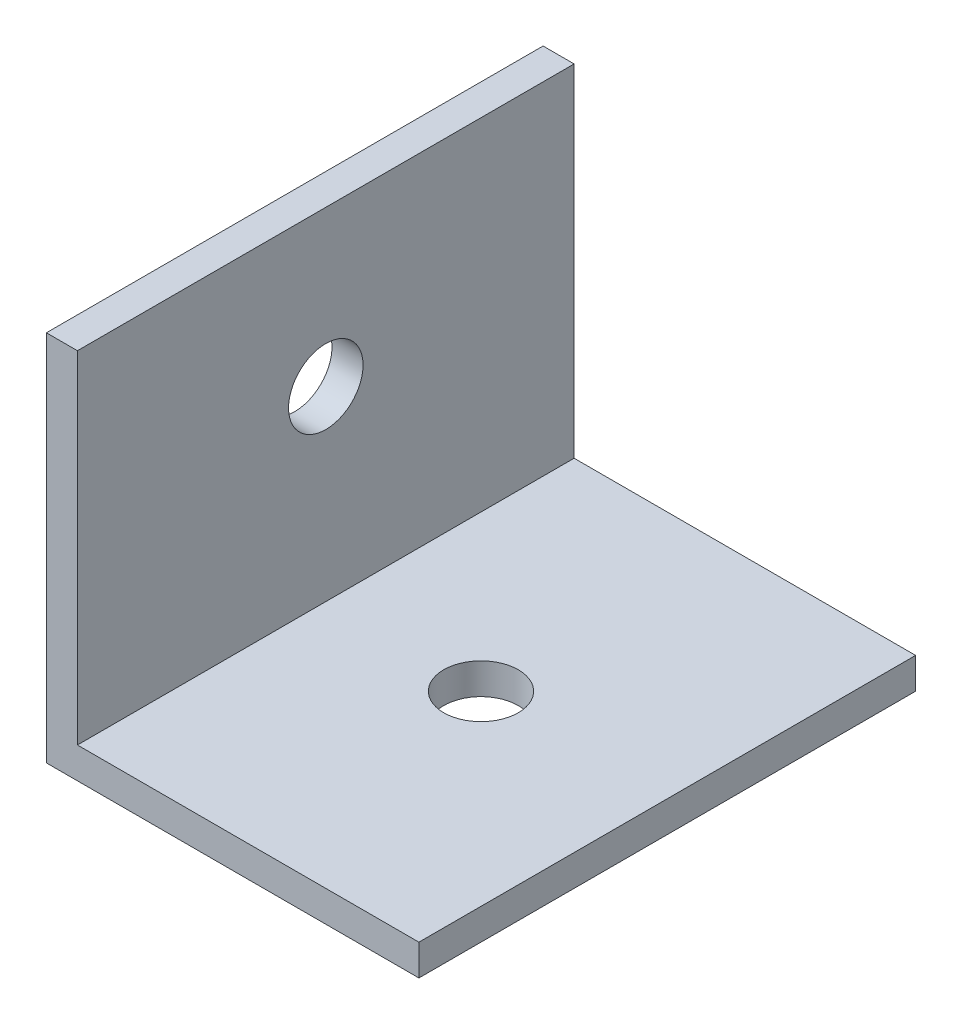
ISO-10303-21;
HEADER;
FILE_DESCRIPTION(('STEP AP214'),'2;1');
FILE_NAME('part.step','',(''),(''),'','','');
FILE_SCHEMA(('AUTOMOTIVE_DESIGN { 1 0 10303 214 1 1 1 1 }'));
ENDSEC;
DATA;
#1=APPLICATION_CONTEXT('core data for automotive mechanical design processes');
#2=APPLICATION_PROTOCOL_DEFINITION('international standard','automotive_design',2000,#1);
#3=PRODUCT_CONTEXT('',#1,'mechanical');
#4=PRODUCT('Part','Part','',(#3));
#5=PRODUCT_RELATED_PRODUCT_CATEGORY('part','',(#4));
#6=PRODUCT_DEFINITION_FORMATION('','',#4);
#7=PRODUCT_DEFINITION_CONTEXT('part definition',#1,'design');
#8=PRODUCT_DEFINITION('design','',#6,#7);
#9=PRODUCT_DEFINITION_SHAPE('','',#8);
#10=(LENGTH_UNIT() NAMED_UNIT(*) SI_UNIT(.MILLI.,.METRE.));
#11=(NAMED_UNIT(*) PLANE_ANGLE_UNIT() SI_UNIT($,.RADIAN.));
#12=(NAMED_UNIT(*) SI_UNIT($,.STERADIAN.) SOLID_ANGLE_UNIT());
#13=UNCERTAINTY_MEASURE_WITH_UNIT(LENGTH_MEASURE(1.E-05),#10,'distance_accuracy_value','');
#14=(GEOMETRIC_REPRESENTATION_CONTEXT(3) GLOBAL_UNCERTAINTY_ASSIGNED_CONTEXT((#13)) GLOBAL_UNIT_ASSIGNED_CONTEXT((#10,
#11,#12)) REPRESENTATION_CONTEXT('',''));
#15=CARTESIAN_POINT('',(0.,0.,0.));
#16=DIRECTION('',(0.,0.,1.));
#17=DIRECTION('',(1.,0.,0.));
#18=AXIS2_PLACEMENT_3D('',#15,#16,#17);
#19=CARTESIAN_POINT('',(0.,0.,40.));
#20=DIRECTION('',(0.,1.,0.));
#21=DIRECTION('',(0.,0.,1.));
#22=AXIS2_PLACEMENT_3D('',#19,#20,#21);
#23=PLANE('',#22);
#24=CARTESIAN_POINT('',(30.,0.,0.));
#25=DIRECTION('',(0.,-1.,0.));
#26=DIRECTION('',(0.,0.,-1.));
#27=AXIS2_PLACEMENT_3D('',#24,#25,#26);
#28=CIRCLE('',#27,6.);
#29=CARTESIAN_POINT('',(30.,0.,-6.));
#30=VERTEX_POINT('',#29);
#31=EDGE_CURVE('E161',#30,#30,#28,.T.);
#32=ORIENTED_EDGE('',*,*,#31,.F.);
#33=EDGE_LOOP('',(#32));
#34=FACE_BOUND('',#33,.T.);
#35=DIRECTION('',(1.,0.,0.));
#36=VECTOR('',#35,1.);
#37=CARTESIAN_POINT('',(0.,0.,-40.));
#38=LINE('',#37,#36);
#39=CARTESIAN_POINT('',(0.,0.,-40.));
#40=VERTEX_POINT('',#39);
#41=CARTESIAN_POINT('',(60.,0.,-40.));
#42=VERTEX_POINT('',#41);
#43=EDGE_CURVE('E115',#40,#42,#38,.T.);
#44=ORIENTED_EDGE('',*,*,#43,.T.);
#45=DIRECTION('',(0.,0.,-1.));
#46=VECTOR('',#45,1.);
#47=CARTESIAN_POINT('',(60.,0.,40.));
#48=LINE('',#47,#46);
#49=CARTESIAN_POINT('',(60.,0.,40.));
#50=VERTEX_POINT('',#49);
#51=EDGE_CURVE('E11',#50,#42,#48,.T.);
#52=ORIENTED_EDGE('',*,*,#51,.F.);
#53=DIRECTION('',(1.,0.,0.));
#54=VECTOR('',#53,1.);
#55=CARTESIAN_POINT('',(0.,0.,40.));
#56=LINE('',#55,#54);
#57=CARTESIAN_POINT('',(0.,0.,40.));
#58=VERTEX_POINT('',#57);
#59=EDGE_CURVE('E80',#58,#50,#56,.T.);
#60=ORIENTED_EDGE('',*,*,#59,.F.);
#61=DIRECTION('',(0.,0.,-1.));
#62=VECTOR('',#61,1.);
#63=CARTESIAN_POINT('',(0.,0.,40.));
#64=LINE('',#63,#62);
#65=EDGE_CURVE('E111',#58,#40,#64,.T.);
#66=ORIENTED_EDGE('',*,*,#65,.T.);
#67=EDGE_LOOP('',(#44,#52,#60,#66));
#68=FACE_BOUND('',#67,.T.);
#69=ADVANCED_FACE('F33',(#34,#68),#23,.F.);
#70=CARTESIAN_POINT('',(60.,5.,40.));
#71=DIRECTION('',(1.,0.,0.));
#72=DIRECTION('',(0.,0.,-1.));
#73=AXIS2_PLACEMENT_3D('',#70,#71,#72);
#74=PLANE('',#73);
#75=DIRECTION('',(0.,-1.,0.));
#76=VECTOR('',#75,1.);
#77=CARTESIAN_POINT('',(60.,5.,-40.));
#78=LINE('',#77,#76);
#79=CARTESIAN_POINT('',(60.,5.,-40.));
#80=VERTEX_POINT('',#79);
#81=EDGE_CURVE('E118',#80,#42,#78,.T.);
#82=ORIENTED_EDGE('',*,*,#81,.F.);
#83=DIRECTION('',(0.,0.,-1.));
#84=VECTOR('',#83,1.);
#85=CARTESIAN_POINT('',(60.,5.,40.));
#86=LINE('',#85,#84);
#87=CARTESIAN_POINT('',(60.,5.,40.));
#88=VERTEX_POINT('',#87);
#89=EDGE_CURVE('E42',#88,#80,#86,.T.);
#90=ORIENTED_EDGE('',*,*,#89,.F.);
#91=DIRECTION('',(0.,-1.,0.));
#92=VECTOR('',#91,1.);
#93=CARTESIAN_POINT('',(60.,5.,40.));
#94=LINE('',#93,#92);
#95=EDGE_CURVE('E172',#88,#50,#94,.T.);
#96=ORIENTED_EDGE('',*,*,#95,.T.);
#97=ORIENTED_EDGE('',*,*,#51,.T.);
#98=EDGE_LOOP('',(#82,#90,#96,#97));
#99=FACE_BOUND('',#98,.T.);
#100=ADVANCED_FACE('F137',(#99),#74,.T.);
#101=CARTESIAN_POINT('',(0.,5.,40.));
#102=DIRECTION('',(0.,1.,0.));
#103=DIRECTION('',(0.,0.,1.));
#104=AXIS2_PLACEMENT_3D('',#101,#102,#103);
#105=PLANE('',#104);
#106=CARTESIAN_POINT('',(30.,5.,0.));
#107=DIRECTION('',(0.,1.,0.));
#108=DIRECTION('',(0.,0.,1.));
#109=AXIS2_PLACEMENT_3D('',#106,#107,#108);
#110=CIRCLE('',#109,6.);
#111=CARTESIAN_POINT('',(30.,5.,6.));
#112=VERTEX_POINT('',#111);
#113=EDGE_CURVE('E36',#112,#112,#110,.T.);
#114=ORIENTED_EDGE('',*,*,#113,.F.);
#115=EDGE_LOOP('',(#114));
#116=FACE_BOUND('',#115,.T.);
#117=DIRECTION('',(1.,0.,0.));
#118=VECTOR('',#117,1.);
#119=CARTESIAN_POINT('',(0.,5.,-40.));
#120=LINE('',#119,#118);
#121=CARTESIAN_POINT('',(5.,5.,-40.));
#122=VERTEX_POINT('',#121);
#123=EDGE_CURVE('E121',#122,#80,#120,.T.);
#124=ORIENTED_EDGE('',*,*,#123,.F.);
#125=DIRECTION('',(0.,0.,-1.));
#126=VECTOR('',#125,1.);
#127=CARTESIAN_POINT('',(5.,5.,40.));
#128=LINE('',#127,#126);
#129=CARTESIAN_POINT('',(5.,5.,40.));
#130=VERTEX_POINT('',#129);
#131=EDGE_CURVE('E101',#130,#122,#128,.T.);
#132=ORIENTED_EDGE('',*,*,#131,.F.);
#133=DIRECTION('',(1.,0.,0.));
#134=VECTOR('',#133,1.);
#135=CARTESIAN_POINT('',(0.,5.,40.));
#136=LINE('',#135,#134);
#137=EDGE_CURVE('E107',#130,#88,#136,.T.);
#138=ORIENTED_EDGE('',*,*,#137,.T.);
#139=ORIENTED_EDGE('',*,*,#89,.T.);
#140=EDGE_LOOP('',(#124,#132,#138,#139));
#141=FACE_BOUND('',#140,.T.);
#142=ADVANCED_FACE('F134',(#116,#141),#105,.T.);
#143=CARTESIAN_POINT('',(5.,0.,40.));
#144=DIRECTION('',(1.,0.,0.));
#145=DIRECTION('',(0.,0.,-1.));
#146=AXIS2_PLACEMENT_3D('',#143,#144,#145);
#147=PLANE('',#146);
#148=CARTESIAN_POINT('',(5.,35.,0.));
#149=DIRECTION('',(1.,0.,0.));
#150=DIRECTION('',(0.,0.,-1.));
#151=AXIS2_PLACEMENT_3D('',#148,#149,#150);
#152=CIRCLE('',#151,5.99999999999999);
#153=CARTESIAN_POINT('',(5.,35.,-5.99999999999999));
#154=VERTEX_POINT('',#153);
#155=EDGE_CURVE('E163',#154,#154,#152,.T.);
#156=ORIENTED_EDGE('',*,*,#155,.F.);
#157=EDGE_LOOP('',(#156));
#158=FACE_BOUND('',#157,.T.);
#159=DIRECTION('',(0.,1.,0.));
#160=VECTOR('',#159,1.);
#161=CARTESIAN_POINT('',(5.,0.,-40.));
#162=LINE('',#161,#160);
#163=CARTESIAN_POINT('',(5.,60.,-40.));
#164=VERTEX_POINT('',#163);
#165=EDGE_CURVE('E96',#164,#122,#162,.F.);
#166=ORIENTED_EDGE('',*,*,#165,.F.);
#167=DIRECTION('',(0.,0.,-1.));
#168=VECTOR('',#167,1.);
#169=CARTESIAN_POINT('',(5.,60.,40.));
#170=LINE('',#169,#168);
#171=CARTESIAN_POINT('',(5.,60.,40.));
#172=VERTEX_POINT('',#171);
#173=EDGE_CURVE('E91',#172,#164,#170,.T.);
#174=ORIENTED_EDGE('',*,*,#173,.F.);
#175=DIRECTION('',(0.,1.,0.));
#176=VECTOR('',#175,1.);
#177=CARTESIAN_POINT('',(5.,0.,40.));
#178=LINE('',#177,#176);
#179=EDGE_CURVE('E94',#172,#130,#178,.F.);
#180=ORIENTED_EDGE('',*,*,#179,.T.);
#181=ORIENTED_EDGE('',*,*,#131,.T.);
#182=EDGE_LOOP('',(#166,#174,#180,#181));
#183=FACE_BOUND('',#182,.T.);
#184=ADVANCED_FACE('F93',(#158,#183),#147,.T.);
#185=CARTESIAN_POINT('',(0.,60.,40.));
#186=DIRECTION('',(0.,1.,0.));
#187=DIRECTION('',(0.,0.,1.));
#188=AXIS2_PLACEMENT_3D('',#185,#186,#187);
#189=PLANE('',#188);
#190=DIRECTION('',(1.,0.,0.));
#191=VECTOR('',#190,1.);
#192=CARTESIAN_POINT('',(0.,60.,-40.));
#193=LINE('',#192,#191);
#194=CARTESIAN_POINT('',(0.,60.,-40.));
#195=VERTEX_POINT('',#194);
#196=EDGE_CURVE('E125',#195,#164,#193,.T.);
#197=ORIENTED_EDGE('',*,*,#196,.F.);
#198=DIRECTION('',(0.,0.,-1.));
#199=VECTOR('',#198,1.);
#200=CARTESIAN_POINT('',(0.,60.,40.));
#201=LINE('',#200,#199);
#202=CARTESIAN_POINT('',(0.,60.,40.));
#203=VERTEX_POINT('',#202);
#204=EDGE_CURVE('E71',#203,#195,#201,.T.);
#205=ORIENTED_EDGE('',*,*,#204,.F.);
#206=DIRECTION('',(1.,0.,0.));
#207=VECTOR('',#206,1.);
#208=CARTESIAN_POINT('',(0.,60.,40.));
#209=LINE('',#208,#207);
#210=EDGE_CURVE('E105',#203,#172,#209,.T.);
#211=ORIENTED_EDGE('',*,*,#210,.T.);
#212=ORIENTED_EDGE('',*,*,#173,.T.);
#213=EDGE_LOOP('',(#197,#205,#211,#212));
#214=FACE_BOUND('',#213,.T.);
#215=ADVANCED_FACE('F109',(#214),#189,.T.);
#216=CARTESIAN_POINT('',(0.,0.,40.));
#217=DIRECTION('',(1.,0.,0.));
#218=DIRECTION('',(0.,0.,-1.));
#219=AXIS2_PLACEMENT_3D('',#216,#217,#218);
#220=PLANE('',#219);
#221=CARTESIAN_POINT('',(0.,35.,0.));
#222=DIRECTION('',(-1.,0.,0.));
#223=DIRECTION('',(0.,0.,1.));
#224=AXIS2_PLACEMENT_3D('',#221,#222,#223);
#225=CIRCLE('',#224,5.99999999999999);
#226=CARTESIAN_POINT('',(0.,35.,5.99999999999999));
#227=VERTEX_POINT('',#226);
#228=EDGE_CURVE('E167',#227,#227,#225,.T.);
#229=ORIENTED_EDGE('',*,*,#228,.F.);
#230=EDGE_LOOP('',(#229));
#231=FACE_BOUND('',#230,.T.);
#232=DIRECTION('',(0.,-1.,0.));
#233=VECTOR('',#232,1.);
#234=CARTESIAN_POINT('',(0.,0.,-40.));
#235=LINE('',#234,#233);
#236=EDGE_CURVE('E74',#195,#40,#235,.T.);
#237=ORIENTED_EDGE('',*,*,#236,.T.);
#238=ORIENTED_EDGE('',*,*,#65,.F.);
#239=DIRECTION('',(0.,-1.,0.));
#240=VECTOR('',#239,1.);
#241=CARTESIAN_POINT('',(0.,0.,40.));
#242=LINE('',#241,#240);
#243=EDGE_CURVE('E50',#203,#58,#242,.T.);
#244=ORIENTED_EDGE('',*,*,#243,.F.);
#245=ORIENTED_EDGE('',*,*,#204,.T.);
#246=EDGE_LOOP('',(#237,#238,#244,#245));
#247=FACE_BOUND('',#246,.T.);
#248=ADVANCED_FACE('F142',(#231,#247),#220,.F.);
#249=CARTESIAN_POINT('',(0.,0.,40.));
#250=DIRECTION('',(0.,0.,-1.));
#251=DIRECTION('',(-1.,0.,0.));
#252=AXIS2_PLACEMENT_3D('',#249,#250,#251);
#253=PLANE('',#252);
#254=ORIENTED_EDGE('',*,*,#59,.T.);
#255=ORIENTED_EDGE('',*,*,#95,.F.);
#256=ORIENTED_EDGE('',*,*,#137,.F.);
#257=ORIENTED_EDGE('',*,*,#179,.F.);
#258=ORIENTED_EDGE('',*,*,#210,.F.);
#259=ORIENTED_EDGE('',*,*,#243,.T.);
#260=EDGE_LOOP('',(#254,#255,#256,#257,#258,#259));
#261=FACE_BOUND('',#260,.T.);
#262=ADVANCED_FACE('F104',(#261),#253,.F.);
#263=CARTESIAN_POINT('',(0.,0.,-40.));
#264=DIRECTION('',(0.,0.,-1.));
#265=DIRECTION('',(-1.,0.,0.));
#266=AXIS2_PLACEMENT_3D('',#263,#264,#265);
#267=PLANE('',#266);
#268=ORIENTED_EDGE('',*,*,#43,.F.);
#269=ORIENTED_EDGE('',*,*,#236,.F.);
#270=ORIENTED_EDGE('',*,*,#196,.T.);
#271=ORIENTED_EDGE('',*,*,#165,.T.);
#272=ORIENTED_EDGE('',*,*,#123,.T.);
#273=ORIENTED_EDGE('',*,*,#81,.T.);
#274=EDGE_LOOP('',(#268,#269,#270,#271,#272,#273));
#275=FACE_BOUND('',#274,.T.);
#276=ADVANCED_FACE('F140',(#275),#267,.T.);
#277=CARTESIAN_POINT('',(30.,60.,0.));
#278=DIRECTION('',(0.,-1.,0.));
#279=DIRECTION('',(0.,0.,-1.));
#280=AXIS2_PLACEMENT_3D('',#277,#278,#279);
#281=CYLINDRICAL_SURFACE('',#280,6.);
#282=ORIENTED_EDGE('',*,*,#113,.T.);
#283=EDGE_LOOP('',(#282));
#284=FACE_BOUND('',#283,.T.);
#285=ORIENTED_EDGE('',*,*,#31,.T.);
#286=EDGE_LOOP('',(#285));
#287=FACE_BOUND('',#286,.T.);
#288=ADVANCED_FACE('F177',(#284,#287),#281,.F.);
#289=CARTESIAN_POINT('',(60.,35.,0.));
#290=DIRECTION('',(-1.,0.,0.));
#291=DIRECTION('',(0.,0.,1.));
#292=AXIS2_PLACEMENT_3D('',#289,#290,#291);
#293=CYLINDRICAL_SURFACE('',#292,5.99999999999999);
#294=ORIENTED_EDGE('',*,*,#155,.T.);
#295=EDGE_LOOP('',(#294));
#296=FACE_BOUND('',#295,.T.);
#297=ORIENTED_EDGE('',*,*,#228,.T.);
#298=EDGE_LOOP('',(#297));
#299=FACE_BOUND('',#298,.T.);
#300=ADVANCED_FACE('F175',(#296,#299),#293,.F.);
#301=CLOSED_SHELL('',(#69,#100,#142,#184,#215,#248,#262,#276,#288,#300));
#302=MANIFOLD_SOLID_BREP('B2',#301);
#303=ADVANCED_BREP_SHAPE_REPRESENTATION('',(#18,#302),#14);
#304=SHAPE_DEFINITION_REPRESENTATION(#9,#303);
ENDSEC;
END-ISO-10303-21;
